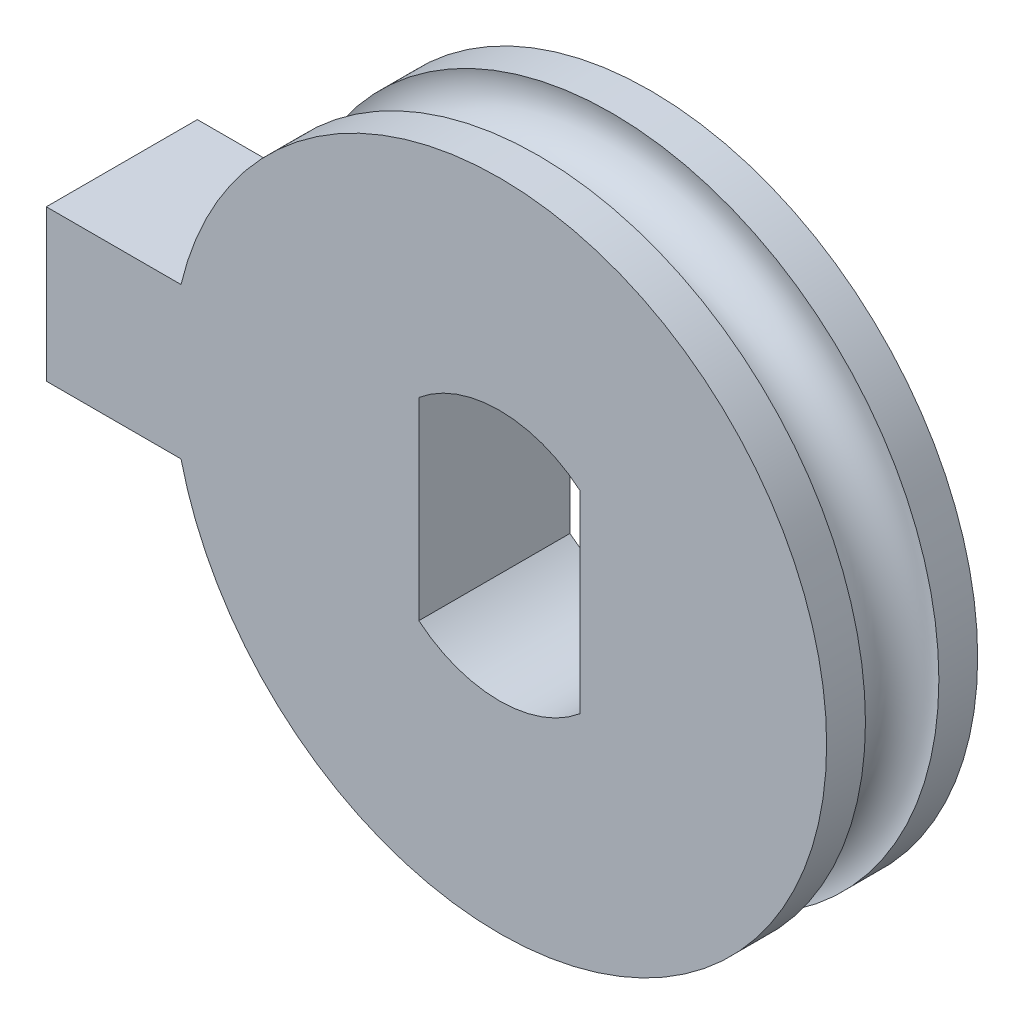
ISO-10303-21;
HEADER;
FILE_DESCRIPTION(('STEP AP214'),'2;1');
FILE_NAME('part.step','',(''),(''),'','','');
FILE_SCHEMA(('AUTOMOTIVE_DESIGN { 1 0 10303 214 1 1 1 1 }'));
ENDSEC;
DATA;
#1=APPLICATION_CONTEXT('core data for automotive mechanical design processes');
#2=APPLICATION_PROTOCOL_DEFINITION('international standard','automotive_design',2000,#1);
#3=PRODUCT_CONTEXT('',#1,'mechanical');
#4=PRODUCT('Part','Part','',(#3));
#5=PRODUCT_RELATED_PRODUCT_CATEGORY('part','',(#4));
#6=PRODUCT_DEFINITION_FORMATION('','',#4);
#7=PRODUCT_DEFINITION_CONTEXT('part definition',#1,'design');
#8=PRODUCT_DEFINITION('design','',#6,#7);
#9=PRODUCT_DEFINITION_SHAPE('','',#8);
#10=(LENGTH_UNIT() NAMED_UNIT(*) SI_UNIT(.MILLI.,.METRE.));
#11=(NAMED_UNIT(*) PLANE_ANGLE_UNIT() SI_UNIT($,.RADIAN.));
#12=(NAMED_UNIT(*) SI_UNIT($,.STERADIAN.) SOLID_ANGLE_UNIT());
#13=UNCERTAINTY_MEASURE_WITH_UNIT(LENGTH_MEASURE(1.E-05),#10,'distance_accuracy_value','');
#14=(GEOMETRIC_REPRESENTATION_CONTEXT(3) GLOBAL_UNCERTAINTY_ASSIGNED_CONTEXT((#13)) GLOBAL_UNIT_ASSIGNED_CONTEXT((#10,
#11,#12)) REPRESENTATION_CONTEXT('',''));
#15=CARTESIAN_POINT('',(0.,0.,0.));
#16=DIRECTION('',(0.,0.,1.));
#17=DIRECTION('',(1.,0.,0.));
#18=AXIS2_PLACEMENT_3D('',#15,#16,#17);
#19=CARTESIAN_POINT('',(0.,0.,3.));
#20=DIRECTION('',(0.,0.,-1.));
#21=DIRECTION('',(-1.,0.,0.));
#22=AXIS2_PLACEMENT_3D('',#19,#20,#21);
#23=CYLINDRICAL_SURFACE('',#22,6.5);
#24=DIRECTION('',(0.,0.,-1.));
#25=VECTOR('',#24,1.);
#26=CARTESIAN_POINT('',(-6.32455532033676,-1.5,3.));
#27=LINE('',#26,#25);
#28=CARTESIAN_POINT('',(-6.32455532033676,-1.5,3.));
#29=VERTEX_POINT('',#28);
#30=CARTESIAN_POINT('',(-6.32455532033676,-1.5,2.22919075993725));
#31=VERTEX_POINT('',#30);
#32=EDGE_CURVE('E138',#29,#31,#27,.T.);
#33=ORIENTED_EDGE('',*,*,#32,.T.);
#34=CARTESIAN_POINT('',(0.,0.,2.22919075993725));
#35=DIRECTION('',(0.,0.,-1.));
#36=DIRECTION('',(-1.,0.,0.));
#37=AXIS2_PLACEMENT_3D('',#34,#35,#36);
#38=CIRCLE('',#37,6.5);
#39=CARTESIAN_POINT('',(-6.32455532033676,1.5,2.22919075993725));
#40=VERTEX_POINT('',#39);
#41=EDGE_CURVE('E126',#31,#40,#38,.F.);
#42=ORIENTED_EDGE('',*,*,#41,.T.);
#43=DIRECTION('',(0.,0.,-1.));
#44=VECTOR('',#43,1.);
#45=CARTESIAN_POINT('',(-6.32455532033676,1.5,3.));
#46=LINE('',#45,#44);
#47=CARTESIAN_POINT('',(-6.32455532033676,1.5,3.));
#48=VERTEX_POINT('',#47);
#49=EDGE_CURVE('E135',#48,#40,#46,.T.);
#50=ORIENTED_EDGE('',*,*,#49,.F.);
#51=CARTESIAN_POINT('',(0.,0.,3.));
#52=DIRECTION('',(0.,0.,1.));
#53=DIRECTION('',(1.,0.,0.));
#54=AXIS2_PLACEMENT_3D('',#51,#52,#53);
#55=CIRCLE('',#54,6.5);
#56=EDGE_CURVE('E196',#29,#48,#55,.T.);
#57=ORIENTED_EDGE('',*,*,#56,.F.);
#58=EDGE_LOOP('',(#33,#42,#50,#57));
#59=FACE_BOUND('',#58,.T.);
#60=ADVANCED_FACE('F45',(#59),#23,.T.);
#61=CARTESIAN_POINT('',(0.,0.,3.));
#62=DIRECTION('',(0.,0.,1.));
#63=DIRECTION('',(1.,0.,0.));
#64=AXIS2_PLACEMENT_3D('',#61,#62,#63);
#65=PLANE('',#64);
#66=DIRECTION('',(0.,-1.,0.));
#67=VECTOR('',#66,1.);
#68=CARTESIAN_POINT('',(-9.,1.5,3.));
#69=LINE('',#68,#67);
#70=CARTESIAN_POINT('',(-9.,1.5,3.));
#71=VERTEX_POINT('',#70);
#72=CARTESIAN_POINT('',(-9.,-1.5,3.));
#73=VERTEX_POINT('',#72);
#74=EDGE_CURVE('E191',#71,#73,#69,.T.);
#75=ORIENTED_EDGE('',*,*,#74,.T.);
#76=DIRECTION('',(1.,0.,0.));
#77=VECTOR('',#76,1.);
#78=CARTESIAN_POINT('',(-9.,-1.5,3.));
#79=LINE('',#78,#77);
#80=EDGE_CURVE('E166',#73,#29,#79,.T.);
#81=ORIENTED_EDGE('',*,*,#80,.T.);
#82=ORIENTED_EDGE('',*,*,#56,.T.);
#83=DIRECTION('',(-1.,0.,0.));
#84=VECTOR('',#83,1.);
#85=CARTESIAN_POINT('',(-9.,1.5,3.));
#86=LINE('',#85,#84);
#87=EDGE_CURVE('E144',#48,#71,#86,.T.);
#88=ORIENTED_EDGE('',*,*,#87,.T.);
#89=EDGE_LOOP('',(#75,#81,#82,#88));
#90=FACE_BOUND('',#89,.T.);
#91=DIRECTION('',(0.,1.,0.));
#92=VECTOR('',#91,1.);
#93=CARTESIAN_POINT('',(1.6,-1.92045554008849,3.));
#94=LINE('',#93,#92);
#95=CARTESIAN_POINT('',(1.6,-1.92045554008849,3.));
#96=VERTEX_POINT('',#95);
#97=CARTESIAN_POINT('',(1.6,1.92045554008849,3.));
#98=VERTEX_POINT('',#97);
#99=EDGE_CURVE('E210',#96,#98,#94,.T.);
#100=ORIENTED_EDGE('',*,*,#99,.F.);
#101=CARTESIAN_POINT('',(0.,0.,3.));
#102=DIRECTION('',(0.,0.,1.));
#103=DIRECTION('',(1.,0.,0.));
#104=AXIS2_PLACEMENT_3D('',#101,#102,#103);
#105=CIRCLE('',#104,2.49962986889191);
#106=CARTESIAN_POINT('',(-1.6,-1.92045554008849,3.));
#107=VERTEX_POINT('',#106);
#108=EDGE_CURVE('E212',#107,#96,#105,.T.);
#109=ORIENTED_EDGE('',*,*,#108,.F.);
#110=DIRECTION('',(0.,-1.,0.));
#111=VECTOR('',#110,1.);
#112=CARTESIAN_POINT('',(-1.6,0.,3.));
#113=LINE('',#112,#111);
#114=CARTESIAN_POINT('',(-1.6,1.92045554008849,3.));
#115=VERTEX_POINT('',#114);
#116=EDGE_CURVE('E222',#115,#107,#113,.T.);
#117=ORIENTED_EDGE('',*,*,#116,.F.);
#118=CARTESIAN_POINT('',(0.,0.,3.));
#119=DIRECTION('',(0.,0.,1.));
#120=DIRECTION('',(1.,0.,0.));
#121=AXIS2_PLACEMENT_3D('',#118,#119,#120);
#122=CIRCLE('',#121,2.49962986889191);
#123=EDGE_CURVE('E213',#98,#115,#122,.T.);
#124=ORIENTED_EDGE('',*,*,#123,.F.);
#125=EDGE_LOOP('',(#100,#109,#117,#124));
#126=FACE_BOUND('',#125,.T.);
#127=ADVANCED_FACE('F202',(#90,#126),#65,.T.);
#128=CARTESIAN_POINT('',(0.,0.,0.));
#129=DIRECTION('',(0.,0.,1.));
#130=DIRECTION('',(1.,0.,0.));
#131=AXIS2_PLACEMENT_3D('',#128,#129,#130);
#132=PLANE('',#131);
#133=DIRECTION('',(0.,-1.,0.));
#134=VECTOR('',#133,1.);
#135=CARTESIAN_POINT('',(-9.,1.5,0.));
#136=LINE('',#135,#134);
#137=CARTESIAN_POINT('',(-9.,1.5,0.));
#138=VERTEX_POINT('',#137);
#139=CARTESIAN_POINT('',(-9.,-1.5,0.));
#140=VERTEX_POINT('',#139);
#141=EDGE_CURVE('E172',#138,#140,#136,.T.);
#142=ORIENTED_EDGE('',*,*,#141,.F.);
#143=DIRECTION('',(-1.,0.,0.));
#144=VECTOR('',#143,1.);
#145=CARTESIAN_POINT('',(-9.,1.5,0.));
#146=LINE('',#145,#144);
#147=CARTESIAN_POINT('',(-6.32455532033676,1.5,0.));
#148=VERTEX_POINT('',#147);
#149=EDGE_CURVE('E189',#148,#138,#146,.T.);
#150=ORIENTED_EDGE('',*,*,#149,.F.);
#151=CARTESIAN_POINT('',(0.,0.,0.));
#152=DIRECTION('',(0.,0.,1.));
#153=DIRECTION('',(1.,0.,0.));
#154=AXIS2_PLACEMENT_3D('',#151,#152,#153);
#155=CIRCLE('',#154,6.5);
#156=CARTESIAN_POINT('',(-6.32455532033676,-1.5,0.));
#157=VERTEX_POINT('',#156);
#158=EDGE_CURVE('E180',#157,#148,#155,.T.);
#159=ORIENTED_EDGE('',*,*,#158,.F.);
#160=DIRECTION('',(1.,0.,0.));
#161=VECTOR('',#160,1.);
#162=CARTESIAN_POINT('',(-9.,-1.5,0.));
#163=LINE('',#162,#161);
#164=EDGE_CURVE('E164',#140,#157,#163,.T.);
#165=ORIENTED_EDGE('',*,*,#164,.F.);
#166=EDGE_LOOP('',(#142,#150,#159,#165));
#167=FACE_BOUND('',#166,.T.);
#168=CARTESIAN_POINT('',(0.,0.,0.));
#169=DIRECTION('',(0.,0.,1.));
#170=DIRECTION('',(1.,0.,0.));
#171=AXIS2_PLACEMENT_3D('',#168,#169,#170);
#172=CIRCLE('',#171,2.49962986889191);
#173=CARTESIAN_POINT('',(-1.6,-1.92045554008849,0.));
#174=VERTEX_POINT('',#173);
#175=CARTESIAN_POINT('',(1.6,-1.92045554008849,0.));
#176=VERTEX_POINT('',#175);
#177=EDGE_CURVE('E226',#174,#176,#172,.T.);
#178=ORIENTED_EDGE('',*,*,#177,.T.);
#179=DIRECTION('',(0.,1.,0.));
#180=VECTOR('',#179,1.);
#181=CARTESIAN_POINT('',(1.6,-1.92045554008849,0.));
#182=LINE('',#181,#180);
#183=CARTESIAN_POINT('',(1.6,1.92045554008849,0.));
#184=VERTEX_POINT('',#183);
#185=EDGE_CURVE('E230',#176,#184,#182,.T.);
#186=ORIENTED_EDGE('',*,*,#185,.T.);
#187=CARTESIAN_POINT('',(0.,0.,0.));
#188=DIRECTION('',(0.,0.,1.));
#189=DIRECTION('',(1.,0.,0.));
#190=AXIS2_PLACEMENT_3D('',#187,#188,#189);
#191=CIRCLE('',#190,2.49962986889191);
#192=CARTESIAN_POINT('',(-1.6,1.92045554008849,0.));
#193=VERTEX_POINT('',#192);
#194=EDGE_CURVE('E234',#184,#193,#191,.T.);
#195=ORIENTED_EDGE('',*,*,#194,.T.);
#196=DIRECTION('',(0.,-1.,0.));
#197=VECTOR('',#196,1.);
#198=CARTESIAN_POINT('',(-1.6,0.,0.));
#199=LINE('',#198,#197);
#200=EDGE_CURVE('E238',#193,#174,#199,.T.);
#201=ORIENTED_EDGE('',*,*,#200,.T.);
#202=EDGE_LOOP('',(#178,#186,#195,#201));
#203=FACE_BOUND('',#202,.T.);
#204=ADVANCED_FACE('F205',(#167,#203),#132,.F.);
#205=CARTESIAN_POINT('',(-9.,1.5,3.));
#206=DIRECTION('',(1.,0.,0.));
#207=DIRECTION('',(0.,0.,-1.));
#208=AXIS2_PLACEMENT_3D('',#205,#206,#207);
#209=PLANE('',#208);
#210=ORIENTED_EDGE('',*,*,#141,.T.);
#211=DIRECTION('',(0.,0.,-1.));
#212=VECTOR('',#211,1.);
#213=CARTESIAN_POINT('',(-9.,-1.5,3.));
#214=LINE('',#213,#212);
#215=EDGE_CURVE('E59',#73,#140,#214,.T.);
#216=ORIENTED_EDGE('',*,*,#215,.F.);
#217=ORIENTED_EDGE('',*,*,#74,.F.);
#218=DIRECTION('',(0.,0.,-1.));
#219=VECTOR('',#218,1.);
#220=CARTESIAN_POINT('',(-9.,1.5,3.));
#221=LINE('',#220,#219);
#222=EDGE_CURVE('E152',#71,#138,#221,.T.);
#223=ORIENTED_EDGE('',*,*,#222,.T.);
#224=EDGE_LOOP('',(#210,#216,#217,#223));
#225=FACE_BOUND('',#224,.T.);
#226=ADVANCED_FACE('F47',(#225),#209,.F.);
#227=CARTESIAN_POINT('',(-9.,-1.5,3.));
#228=DIRECTION('',(0.,1.,0.));
#229=DIRECTION('',(0.,0.,1.));
#230=AXIS2_PLACEMENT_3D('',#227,#228,#229);
#231=PLANE('',#230);
#232=CARTESIAN_POINT('',(-6.32455532033676,-1.5,0.770809240062752));
#233=VERTEX_POINT('',#232);
#234=EDGE_CURVE('E146',#233,#157,#27,.T.);
#235=ORIENTED_EDGE('',*,*,#234,.F.);
#236=CARTESIAN_POINT('',(-6.75454406365264,-1.5,1.04280918848438));
#237=CARTESIAN_POINT('',(-6.78029610390421,-1.5,1.07550388517524));
#238=CARTESIAN_POINT('',(-6.80334103733584,-1.5,1.1103642665946));
#239=CARTESIAN_POINT('',(-6.84328969068853,-1.5,1.18347568408489));
#240=CARTESIAN_POINT('',(-6.8601875611721,-1.5,1.22172990685276));
#241=CARTESIAN_POINT('',(-6.88729242590751,-1.5,1.30055262782057));
#242=CARTESIAN_POINT('',(-6.89749829439957,-1.5,1.34112151415688));
#243=CARTESIAN_POINT('',(-6.91088111941595,-1.5,1.42339413492345));
#244=CARTESIAN_POINT('',(-6.91405964669728,-1.5,1.46509761363859));
#245=CARTESIAN_POINT('',(-6.91329361302847,-1.5,1.54806797095001));
#246=CARTESIAN_POINT('',(-6.90941194319881,-1.5,1.5893354428294));
#247=CARTESIAN_POINT('',(-6.89477209238347,-1.5,1.67063126995464));
#248=CARTESIAN_POINT('',(-6.88401385654549,-1.5,1.71065961531368));
#249=CARTESIAN_POINT('',(-6.85596298220879,-1.5,1.78834616190829));
#250=CARTESIAN_POINT('',(-6.83867152408913,-1.5,1.82600478985571));
#251=CARTESIAN_POINT('',(-6.79808773401467,-1.5,1.89793356201799));
#252=CARTESIAN_POINT('',(-6.77479513723505,-1.5,1.93220355660314));
#253=CARTESIAN_POINT('',(-6.72257499876956,-1.5,1.99686430069969));
#254=CARTESIAN_POINT('',(-6.69357964815034,-1.5,2.02720025451143));
#255=CARTESIAN_POINT('',(-6.63100434005891,-1.5,2.08269983410092));
#256=CARTESIAN_POINT('',(-6.5974239355467,-1.5,2.10786295493042));
#257=CARTESIAN_POINT('',(-6.52585330653291,-1.5,2.15289709252301));
#258=CARTESIAN_POINT('',(-6.48778269123393,-1.5,2.17264031501238));
#259=CARTESIAN_POINT('',(-6.4089240943963,-1.5,2.20562811033633));
#260=CARTESIAN_POINT('',(-6.36813576825217,-1.5,2.21887185725012));
#261=CARTESIAN_POINT('',(-6.28393951086257,-1.5,2.23881294215696));
#262=CARTESIAN_POINT('',(-6.24049199691654,-1.5,2.24534325339725));
#263=CARTESIAN_POINT('',(-6.15311388860968,-1.5,2.25115622222108));
#264=CARTESIAN_POINT('',(-6.10918323895346,-1.5,2.25043804139971));
#265=CARTESIAN_POINT('',(-6.02126218132993,-1.5,2.24171790813664));
#266=CARTESIAN_POINT('',(-5.97728448705952,-1.5,2.23358721723969));
#267=CARTESIAN_POINT('',(-5.89130866771184,-1.5,2.21007449229579));
#268=CARTESIAN_POINT('',(-5.84931064592858,-1.5,2.19469208033308));
#269=CARTESIAN_POINT('',(-5.76843761178748,-1.5,2.15702660223794));
#270=CARTESIAN_POINT('',(-5.72956816985672,-1.5,2.13473155619236));
#271=CARTESIAN_POINT('',(-5.65621677527938,-1.5,2.08381341056025));
#272=CARTESIAN_POINT('',(-5.62173448797928,-1.5,2.05519079409924));
#273=CARTESIAN_POINT('',(-5.55887933570537,-1.5,1.99297523954988));
#274=CARTESIAN_POINT('',(-5.530402694162,-1.5,1.95948725426133));
#275=CARTESIAN_POINT('',(-5.4797094612731,-1.5,1.88806548856396));
#276=CARTESIAN_POINT('',(-5.45749157688656,-1.5,1.85013262874968));
#277=CARTESIAN_POINT('',(-5.4207489303219,-1.5,1.77226393556917));
#278=CARTESIAN_POINT('',(-5.40599071798807,-1.5,1.73243825936166));
#279=CARTESIAN_POINT('',(-5.38360670075417,-1.5,1.65083153399338));
#280=CARTESIAN_POINT('',(-5.37597942389717,-1.5,1.60905089024458));
#281=CARTESIAN_POINT('',(-5.36826046396545,-1.5,1.52607824887141));
#282=CARTESIAN_POINT('',(-5.36794781212387,-1.5,1.48490667563998));
#283=CARTESIAN_POINT('',(-5.37430641470786,-1.5,1.40310909983673));
#284=CARTESIAN_POINT('',(-5.38097714298514,-1.5,1.36248305639666));
#285=CARTESIAN_POINT('',(-5.40097681425989,-1.5,1.2832808659259));
#286=CARTESIAN_POINT('',(-5.41424814927489,-1.5,1.24469012363936));
#287=CARTESIAN_POINT('',(-5.44697132118641,-1.5,1.17022812260774));
#288=CARTESIAN_POINT('',(-5.46642356579334,-1.5,1.13435704345275));
#289=CARTESIAN_POINT('',(-5.51128434047682,-1.5,1.0656485552542));
#290=CARTESIAN_POINT('',(-5.53679215911599,-1.5,1.03287604469043));
#291=CARTESIAN_POINT('',(-5.59278655307377,-1.5,0.971906306649878));
#292=CARTESIAN_POINT('',(-5.62327390302675,-1.5,0.943709792394806));
#293=CARTESIAN_POINT('',(-5.68943066799212,-1.5,0.891706035542831));
#294=CARTESIAN_POINT('',(-5.72523755213298,-1.5,0.868073678887331));
#295=CARTESIAN_POINT('',(-5.80021770186341,-1.5,0.82694675654425));
#296=CARTESIAN_POINT('',(-5.83939152534972,-1.5,0.809453210498638));
#297=CARTESIAN_POINT('',(-5.92127838261432,-1.5,0.780574394700629));
#298=CARTESIAN_POINT('',(-5.96406289554522,-1.5,0.769391542885988));
#299=CARTESIAN_POINT('',(-6.0508921525442,-1.5,0.754253477648799));
#300=CARTESIAN_POINT('',(-6.09493697739002,-1.5,0.750298728558927));
#301=CARTESIAN_POINT('',(-6.18370215308655,-1.5,0.749729940751804));
#302=CARTESIAN_POINT('',(-6.22842323285587,-1.5,0.753220708412525));
#303=CARTESIAN_POINT('',(-6.31664855685912,-1.5,0.767705463129344));
#304=CARTESIAN_POINT('',(-6.36015250549568,-1.5,0.77870125669915));
#305=CARTESIAN_POINT('',(-6.44442404591893,-1.5,0.807867732723881));
#306=CARTESIAN_POINT('',(-6.48520500927754,-1.5,0.825999787824745));
#307=CARTESIAN_POINT('',(-6.56301681465457,-1.5,0.868981593607467));
#308=CARTESIAN_POINT('',(-6.60005247497591,-1.5,0.893822558243558));
#309=CARTESIAN_POINT('',(-6.65680987704485,-1.5,0.939528607704963));
#310=CARTESIAN_POINT('',(-6.6779785322971,-1.5,0.958626099544581));
#311=CARTESIAN_POINT('',(-6.71803526261517,-1.5,0.999080836576147));
#312=CARTESIAN_POINT('',(-6.73692338320588,-1.5,1.02043803664297));
#313=CARTESIAN_POINT('',(-6.75454406365264,-1.5,1.04280918848438));
#314=B_SPLINE_CURVE_WITH_KNOTS('',3,(#236,#237,#238,#239,#240,#241,#242,#243,#244,#245,#246,
#247,#248,#249,#250,#251,#252,#253,#254,#255,#256,#257,#258,#259,#260,#261,#262,#263,#264,#265,
#266,#267,#268,#269,#270,#271,#272,#273,#274,#275,#276,#277,#278,#279,#280,#281,#282,#283,#284,
#285,#286,#287,#288,#289,#290,#291,#292,#293,#294,#295,#296,#297,#298,#299,#300,#301,#302,#303,
#304,#305,#306,#307,#308,#309,#310,#311,#312,#313),.UNSPECIFIED.,.T.,.F.,(4,2,2,2,2,2,2,2,2,2,2,
2,2,2,2,2,2,2,2,2,2,2,2,2,2,2,2,2,2,2,2,2,2,2,2,2,2,2,4),(0.,0.124754296532232,
0.249626998437918,0.374520701625904,0.499386485648276,0.623145427469886,0.746905356491772,
0.870642936078468,0.994385977028128,1.11970060357145,1.24502745695174,1.37309561079986,
1.50118003469604,1.63237920297588,1.76359354672757,1.89713112006241,2.03067565333565,
2.16445293143191,2.2982199988303,2.42944143127331,2.56063573383469,2.68742096930762,
2.8141800281819,2.93710468841991,3.0600200878209,3.18188106501468,3.30375008217487,
3.42777517466747,3.55181957937206,3.67994422486803,3.80809014150386,3.94014168920037,
4.07220171957843,4.20613294210649,4.34009641421756,4.47334452330242,4.60641896866575,
4.69178305875811,4.77714544449849),.UNSPECIFIED.);
#315=EDGE_CURVE('E140',#233,#31,#314,.T.);
#316=ORIENTED_EDGE('',*,*,#315,.T.);
#317=ORIENTED_EDGE('',*,*,#32,.F.);
#318=ORIENTED_EDGE('',*,*,#80,.F.);
#319=ORIENTED_EDGE('',*,*,#215,.T.);
#320=ORIENTED_EDGE('',*,*,#164,.T.);
#321=EDGE_LOOP('',(#235,#316,#317,#318,#319,#320));
#322=FACE_BOUND('',#321,.T.);
#323=ADVANCED_FACE('F163',(#322),#231,.F.);
#324=CARTESIAN_POINT('',(-6.32455532033676,1.5,0.770809240062746));
#325=VERTEX_POINT('',#324);
#326=EDGE_CURVE('E147',#325,#148,#46,.T.);
#327=ORIENTED_EDGE('',*,*,#326,.F.);
#328=CARTESIAN_POINT('',(0.,0.,0.770809240062752));
#329=DIRECTION('',(0.,0.,1.));
#330=DIRECTION('',(1.,0.,0.));
#331=AXIS2_PLACEMENT_3D('',#328,#329,#330);
#332=CIRCLE('',#331,6.5);
#333=EDGE_CURVE('E66',#325,#233,#332,.F.);
#334=ORIENTED_EDGE('',*,*,#333,.T.);
#335=ORIENTED_EDGE('',*,*,#234,.T.);
#336=ORIENTED_EDGE('',*,*,#158,.T.);
#337=EDGE_LOOP('',(#327,#334,#335,#336));
#338=FACE_BOUND('',#337,.T.);
#339=ADVANCED_FACE('F282',(#338),#23,.T.);
#340=CARTESIAN_POINT('',(-9.,1.5,3.));
#341=DIRECTION('',(0.,-1.,0.));
#342=DIRECTION('',(0.,0.,-1.));
#343=AXIS2_PLACEMENT_3D('',#340,#341,#342);
#344=PLANE('',#343);
#345=ORIENTED_EDGE('',*,*,#49,.T.);
#346=CARTESIAN_POINT('',(-6.75454406365264,1.5,1.04280918848438));
#347=CARTESIAN_POINT('',(-6.72794758360218,1.5,1.0090486827123));
#348=CARTESIAN_POINT('',(-6.69842392143155,1.5,0.977548021269796));
#349=CARTESIAN_POINT('',(-6.63445134510452,1.5,0.919959790284288));
#350=CARTESIAN_POINT('',(-6.59999514101484,1.5,0.893880375370169));
#351=CARTESIAN_POINT('',(-6.52726917059621,1.5,0.84787389295058));
#352=CARTESIAN_POINT('',(-6.48900534325324,1.5,0.827937436872475));
#353=CARTESIAN_POINT('',(-6.40973273899624,1.5,0.794645520499673));
#354=CARTESIAN_POINT('',(-6.36872465454023,1.5,0.781288407099281));
#355=CARTESIAN_POINT('',(-6.28430832764395,1.5,0.761253415168267));
#356=CARTESIAN_POINT('',(-6.24086976481733,1.5,0.754703288846452));
#357=CARTESIAN_POINT('',(-6.15350386246199,1.5,0.748848490382866));
#358=CARTESIAN_POINT('',(-6.10957644474338,1.5,0.74954499443752));
#359=CARTESIAN_POINT('',(-6.02165527419208,1.5,0.758220881635909));
#360=CARTESIAN_POINT('',(-5.97767421891471,1.5,0.766329487054564));
#361=CARTESIAN_POINT('',(-5.89168801086872,1.5,0.789798681267359));
#362=CARTESIAN_POINT('',(-5.84968295803041,1.5,0.805159636394379));
#363=CARTESIAN_POINT('',(-5.76879089963043,1.5,0.842783925609337));
#364=CARTESIAN_POINT('',(-5.72990955703816,1.5,0.865059454834897));
#365=CARTESIAN_POINT('',(-5.65653112832933,1.5,0.915940642563402));
#366=CARTESIAN_POINT('',(-5.62203369805856,1.5,0.944545803681667));
#367=CARTESIAN_POINT('',(-5.55914454825469,1.5,1.00673039269575));
#368=CARTESIAN_POINT('',(-5.53064927361928,1.5,1.04020498284393));
#369=CARTESIAN_POINT('',(-5.47991660379097,1.5,1.1116034047248));
#370=CARTESIAN_POINT('',(-5.45767792507342,1.5,1.14952632162943));
#371=CARTESIAN_POINT('',(-5.42089276192802,1.5,1.22737962914114));
#372=CARTESIAN_POINT('',(-5.40611294410748,1.5,1.26719976822785));
#373=CARTESIAN_POINT('',(-5.38368524761403,1.5,1.34879926881648));
#374=CARTESIAN_POINT('',(-5.37603589350476,1.5,1.39057822312013));
#375=CARTESIAN_POINT('',(-5.36827388246745,1.5,1.47355050999728));
#376=CARTESIAN_POINT('',(-5.36794009958675,1.5,1.51472328868488));
#377=CARTESIAN_POINT('',(-5.37425724984832,1.5,1.59652678309843));
#378=CARTESIAN_POINT('',(-5.38090765353543,1.5,1.63715753967739));
#379=CARTESIAN_POINT('',(-5.40086793046628,1.5,1.71637070113617));
#380=CARTESIAN_POINT('',(-5.41411991160903,1.5,1.7549677424343));
#381=CARTESIAN_POINT('',(-5.44680590757859,1.5,1.82944536715841));
#382=CARTESIAN_POINT('',(-5.46624033504323,1.5,1.86532576906855));
#383=CARTESIAN_POINT('',(-5.51106640896105,1.5,1.93405453028156));
#384=CARTESIAN_POINT('',(-5.5365571887837,1.5,1.96683816164204));
#385=CARTESIAN_POINT('',(-5.59251953892938,1.5,2.02783264703352));
#386=CARTESIAN_POINT('',(-5.62299187526113,1.5,2.05604279647417));
#387=CARTESIAN_POINT('',(-5.68912028146627,1.5,2.1080763020684));
#388=CARTESIAN_POINT('',(-5.72491386631809,1.5,2.13172488867889));
#389=CARTESIAN_POINT('',(-5.79987011804311,1.5,2.17288628060675));
#390=CARTESIAN_POINT('',(-5.83903333746011,1.5,2.19039807723204));
#391=CARTESIAN_POINT('',(-5.9209016351122,1.5,2.21931560070755));
#392=CARTESIAN_POINT('',(-5.96367827998665,1.5,2.23051897908342));
#393=CARTESIAN_POINT('',(-6.05049685163149,1.5,2.24569983242574));
#394=CARTESIAN_POINT('',(-6.09453890725817,1.5,2.2496765688381));
#395=CARTESIAN_POINT('',(-6.18330843051846,1.5,2.25028980044188));
#396=CARTESIAN_POINT('',(-6.22803669073664,1.5,2.24682048262807));
#397=CARTESIAN_POINT('',(-6.31626801266148,1.5,2.23237909225033));
#398=CARTESIAN_POINT('',(-6.35977108056701,1.5,2.22140705765353));
#399=CARTESIAN_POINT('',(-6.44402944502631,1.5,2.19229219266437));
#400=CARTESIAN_POINT('',(-6.48479919167976,1.5,2.1741912454454));
#401=CARTESIAN_POINT('',(-6.56263226207659,1.5,2.13126357698668));
#402=CARTESIAN_POINT('',(-6.59969594781154,1.5,2.10643751350674));
#403=CARTESIAN_POINT('',(-6.668241727526,1.5,2.0512917339024));
#404=CARTESIAN_POINT('',(-6.69982228259799,1.5,2.02109445355626));
#405=CARTESIAN_POINT('',(-6.75730589993303,1.5,1.95570667911307));
#406=CARTESIAN_POINT('',(-6.7832097599119,1.5,1.92051688773349));
#407=CARTESIAN_POINT('',(-6.82792354268723,1.5,1.84708842702607));
#408=CARTESIAN_POINT('',(-6.84689416147224,1.5,1.80894759009428));
#409=CARTESIAN_POINT('',(-6.87801287436511,1.5,1.72997920647344));
#410=CARTESIAN_POINT('',(-6.89016210094471,1.5,1.68915210700955));
#411=CARTESIAN_POINT('',(-6.90706753255555,1.5,1.60684751044501));
#412=CARTESIAN_POINT('',(-6.91196659420384,1.5,1.56539930450903));
#413=CARTESIAN_POINT('',(-6.91467075017882,1.5,1.48226135252964));
#414=CARTESIAN_POINT('',(-6.91247445837487,1.5,1.44057156087874));
#415=CARTESIAN_POINT('',(-6.90110530616154,1.5,1.35850391581203));
#416=CARTESIAN_POINT('',(-6.8919888042529,1.5,1.31811819789137));
#417=CARTESIAN_POINT('',(-6.86713874413045,1.5,1.23947676599248));
#418=CARTESIAN_POINT('',(-6.85141350678225,1.5,1.20121844182586));
#419=CARTESIAN_POINT('',(-6.82163931208211,1.5,1.14305583351378));
#420=CARTESIAN_POINT('',(-6.80958690729869,1.5,1.12210477167516));
#421=CARTESIAN_POINT('',(-6.78351247911182,1.5,1.08146765605217));
#422=CARTESIAN_POINT('',(-6.76949048854797,1.5,1.0617815811842));
#423=CARTESIAN_POINT('',(-6.75454406365264,1.5,1.04280918848438));
#424=B_SPLINE_CURVE_WITH_KNOTS('',3,(#346,#347,#348,#349,#350,#351,#352,#353,#354,#355,#356,
#357,#358,#359,#360,#361,#362,#363,#364,#365,#366,#367,#368,#369,#370,#371,#372,#373,#374,#375,
#376,#377,#378,#379,#380,#381,#382,#383,#384,#385,#386,#387,#388,#389,#390,#391,#392,#393,#394,
#395,#396,#397,#398,#399,#400,#401,#402,#403,#404,#405,#406,#407,#408,#409,#410,#411,#412,#413,
#414,#415,#416,#417,#418,#419,#420,#421,#422,#423),.UNSPECIFIED.,.T.,.F.,(4,2,2,2,2,2,2,2,2,2,2,
2,2,2,2,2,2,2,2,2,2,2,2,2,2,2,2,2,2,2,2,2,2,2,2,2,2,2,4),(0.,0.12884445205508,0.2578813312539,
0.386720007764657,0.515526296126668,0.646708585134383,0.777912166596406,0.911447695766442,
1.04498997084528,1.17876912377747,1.31253776802804,1.44376480327764,1.57496489797345,
1.70175704537468,1.82852295110273,1.95145167033984,2.07437107130521,2.19623102826111,
2.31809912027852,2.44211917172453,2.56615831157294,2.69427653288393,2.8224158028682,
2.95446015897051,3.086518009088,3.22046489507222,3.35441110322972,3.48758182821711,
3.62073953294727,3.75118013186745,3.88160238889213,4.00877448873177,4.13592546950634,
4.26053608371373,4.38517104301354,4.50880171687076,4.63227719510909,4.70468512382133,
4.77709184539377),.UNSPECIFIED.);
#425=EDGE_CURVE('E11',#40,#325,#424,.T.);
#426=ORIENTED_EDGE('',*,*,#425,.T.);
#427=ORIENTED_EDGE('',*,*,#326,.T.);
#428=ORIENTED_EDGE('',*,*,#149,.T.);
#429=ORIENTED_EDGE('',*,*,#222,.F.);
#430=ORIENTED_EDGE('',*,*,#87,.F.);
#431=EDGE_LOOP('',(#345,#426,#427,#428,#429,#430));
#432=FACE_BOUND('',#431,.T.);
#433=ADVANCED_FACE('F142',(#432),#344,.F.);
#434=CARTESIAN_POINT('',(0.,0.,3.));
#435=DIRECTION('',(0.,0.,-1.));
#436=DIRECTION('',(-1.,0.,0.));
#437=AXIS2_PLACEMENT_3D('',#434,#435,#436);
#438=CYLINDRICAL_SURFACE('',#437,2.49962986889191);
#439=ORIENTED_EDGE('',*,*,#177,.F.);
#440=DIRECTION('',(0.,0.,-1.));
#441=VECTOR('',#440,1.);
#442=CARTESIAN_POINT('',(-1.6,-1.92045554008849,3.));
#443=LINE('',#442,#441);
#444=EDGE_CURVE('E176',#107,#174,#443,.T.);
#445=ORIENTED_EDGE('',*,*,#444,.F.);
#446=ORIENTED_EDGE('',*,*,#108,.T.);
#447=DIRECTION('',(0.,0.,-1.));
#448=VECTOR('',#447,1.);
#449=CARTESIAN_POINT('',(1.6,-1.92045554008849,3.));
#450=LINE('',#449,#448);
#451=EDGE_CURVE('E182',#96,#176,#450,.T.);
#452=ORIENTED_EDGE('',*,*,#451,.T.);
#453=EDGE_LOOP('',(#439,#445,#446,#452));
#454=FACE_BOUND('',#453,.T.);
#455=ADVANCED_FACE('F250',(#454),#438,.F.);
#456=CARTESIAN_POINT('',(1.6,-1.92045554008849,3.));
#457=DIRECTION('',(-1.,0.,0.));
#458=DIRECTION('',(0.,0.,1.));
#459=AXIS2_PLACEMENT_3D('',#456,#457,#458);
#460=PLANE('',#459);
#461=ORIENTED_EDGE('',*,*,#185,.F.);
#462=ORIENTED_EDGE('',*,*,#451,.F.);
#463=ORIENTED_EDGE('',*,*,#99,.T.);
#464=DIRECTION('',(0.,0.,-1.));
#465=VECTOR('',#464,1.);
#466=CARTESIAN_POINT('',(1.6,1.92045554008849,3.));
#467=LINE('',#466,#465);
#468=EDGE_CURVE('E244',#98,#184,#467,.T.);
#469=ORIENTED_EDGE('',*,*,#468,.T.);
#470=EDGE_LOOP('',(#461,#462,#463,#469));
#471=FACE_BOUND('',#470,.T.);
#472=ADVANCED_FACE('F252',(#471),#460,.T.);
#473=CARTESIAN_POINT('',(0.,0.,3.));
#474=DIRECTION('',(0.,0.,-1.));
#475=DIRECTION('',(-1.,0.,0.));
#476=AXIS2_PLACEMENT_3D('',#473,#474,#475);
#477=CYLINDRICAL_SURFACE('',#476,2.49962986889191);
#478=ORIENTED_EDGE('',*,*,#194,.F.);
#479=ORIENTED_EDGE('',*,*,#468,.F.);
#480=ORIENTED_EDGE('',*,*,#123,.T.);
#481=DIRECTION('',(0.,0.,-1.));
#482=VECTOR('',#481,1.);
#483=CARTESIAN_POINT('',(-1.6,1.92045554008849,3.));
#484=LINE('',#483,#482);
#485=EDGE_CURVE('E73',#115,#193,#484,.T.);
#486=ORIENTED_EDGE('',*,*,#485,.T.);
#487=EDGE_LOOP('',(#478,#479,#480,#486));
#488=FACE_BOUND('',#487,.T.);
#489=ADVANCED_FACE('F271',(#488),#477,.F.);
#490=CARTESIAN_POINT('',(-1.6,0.,3.));
#491=DIRECTION('',(1.,0.,0.));
#492=DIRECTION('',(0.,1.,0.));
#493=AXIS2_PLACEMENT_3D('',#490,#491,#492);
#494=PLANE('',#493);
#495=ORIENTED_EDGE('',*,*,#200,.F.);
#496=ORIENTED_EDGE('',*,*,#485,.F.);
#497=ORIENTED_EDGE('',*,*,#116,.T.);
#498=ORIENTED_EDGE('',*,*,#444,.T.);
#499=EDGE_LOOP('',(#495,#496,#497,#498));
#500=FACE_BOUND('',#499,.T.);
#501=ADVANCED_FACE('F255',(#500),#494,.T.);
#502=CARTESIAN_POINT('',(0.,0.,1.5));
#503=DIRECTION('',(0.,0.,1.));
#504=DIRECTION('',(1.,0.,0.));
#505=AXIS2_PLACEMENT_3D('',#502,#503,#504);
#506=TOROIDAL_SURFACE('',#505,6.32455532033676,0.749999999999999);
#507=ORIENTED_EDGE('',*,*,#333,.F.);
#508=ORIENTED_EDGE('',*,*,#425,.F.);
#509=ORIENTED_EDGE('',*,*,#41,.F.);
#510=ORIENTED_EDGE('',*,*,#315,.F.);
#511=EDGE_LOOP('',(#507,#508,#509,#510));
#512=FACE_BOUND('',#511,.T.);
#513=ADVANCED_FACE('F125',(#512),#506,.F.);
#514=CLOSED_SHELL('',(#60,#127,#204,#226,#323,#339,#433,#455,#472,#489,#501,#513));
#515=MANIFOLD_SOLID_BREP('B2',#514);
#516=ADVANCED_BREP_SHAPE_REPRESENTATION('',(#18,#515),#14);
#517=SHAPE_DEFINITION_REPRESENTATION(#9,#516);
ENDSEC;
END-ISO-10303-21;
